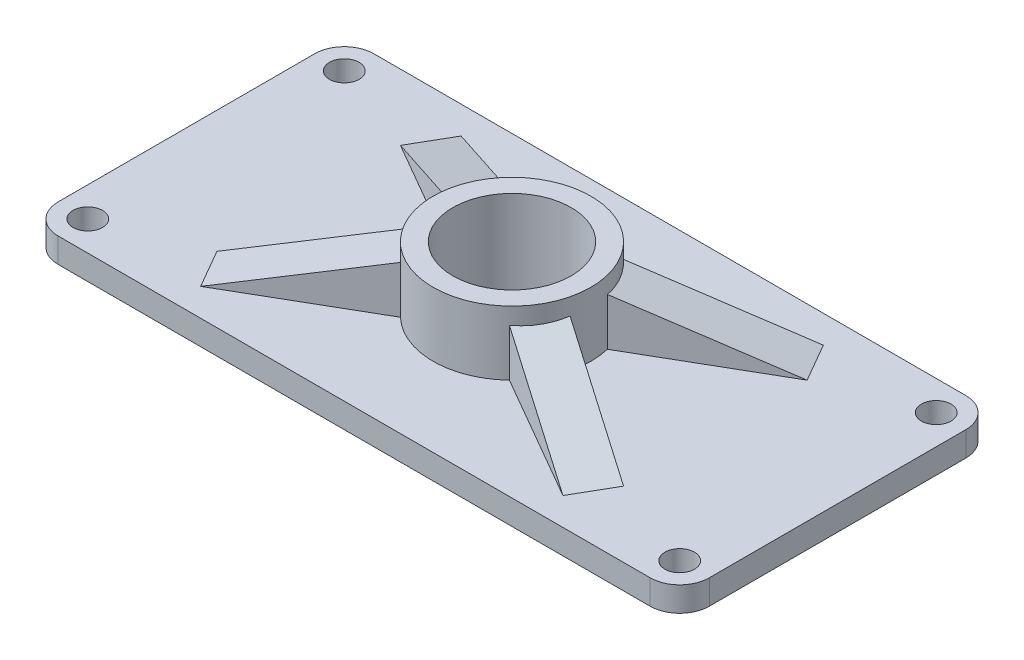
ISO-10303-21;
HEADER;
FILE_DESCRIPTION(('STEP AP214'),'2;1');
FILE_NAME('part.step','',(''),(''),'','','');
FILE_SCHEMA(('AUTOMOTIVE_DESIGN { 1 0 10303 214 1 1 1 1 }'));
ENDSEC;
DATA;
#1=APPLICATION_CONTEXT('core data for automotive mechanical design processes');
#2=APPLICATION_PROTOCOL_DEFINITION('international standard','automotive_design',2000,#1);
#3=PRODUCT_CONTEXT('',#1,'mechanical');
#4=PRODUCT('Part','Part','',(#3));
#5=PRODUCT_RELATED_PRODUCT_CATEGORY('part','',(#4));
#6=PRODUCT_DEFINITION_FORMATION('','',#4);
#7=PRODUCT_DEFINITION_CONTEXT('part definition',#1,'design');
#8=PRODUCT_DEFINITION('design','',#6,#7);
#9=PRODUCT_DEFINITION_SHAPE('','',#8);
#10=(LENGTH_UNIT() NAMED_UNIT(*) SI_UNIT(.MILLI.,.METRE.));
#11=(NAMED_UNIT(*) PLANE_ANGLE_UNIT() SI_UNIT($,.RADIAN.));
#12=(NAMED_UNIT(*) SI_UNIT($,.STERADIAN.) SOLID_ANGLE_UNIT());
#13=UNCERTAINTY_MEASURE_WITH_UNIT(LENGTH_MEASURE(1.E-05),#10,'distance_accuracy_value','');
#14=(GEOMETRIC_REPRESENTATION_CONTEXT(3) GLOBAL_UNCERTAINTY_ASSIGNED_CONTEXT((#13)) GLOBAL_UNIT_ASSIGNED_CONTEXT((#10,
#11,#12)) REPRESENTATION_CONTEXT('',''));
#15=CARTESIAN_POINT('',(0.,0.,0.));
#16=DIRECTION('',(0.,0.,1.));
#17=DIRECTION('',(1.,0.,0.));
#18=AXIS2_PLACEMENT_3D('',#15,#16,#17);
#19=CARTESIAN_POINT('',(60.,5.,-26.));
#20=DIRECTION('',(0.,-1.,0.));
#21=DIRECTION('',(0.,0.,-1.));
#22=AXIS2_PLACEMENT_3D('',#19,#20,#21);
#23=PLANE('',#22);
#24=CARTESIAN_POINT('',(60.,5.,26.));
#25=DIRECTION('',(0.,1.,0.));
#26=DIRECTION('',(0.,0.,1.));
#27=AXIS2_PLACEMENT_3D('',#24,#25,#26);
#28=CIRCLE('',#27,3.);
#29=CARTESIAN_POINT('',(60.,5.,29.));
#30=VERTEX_POINT('',#29);
#31=EDGE_CURVE('E339',#30,#30,#28,.T.);
#32=ORIENTED_EDGE('',*,*,#31,.F.);
#33=EDGE_LOOP('',(#32));
#34=FACE_BOUND('',#33,.T.);
#35=CARTESIAN_POINT('',(60.,5.,-26.));
#36=DIRECTION('',(0.,1.,0.));
#37=DIRECTION('',(0.,0.,1.));
#38=AXIS2_PLACEMENT_3D('',#35,#36,#37);
#39=CIRCLE('',#38,3.);
#40=CARTESIAN_POINT('',(60.,5.,-23.));
#41=VERTEX_POINT('',#40);
#42=EDGE_CURVE('E331',#41,#41,#39,.T.);
#43=ORIENTED_EDGE('',*,*,#42,.F.);
#44=EDGE_LOOP('',(#43));
#45=FACE_BOUND('',#44,.T.);
#46=CARTESIAN_POINT('',(-60.,5.,26.));
#47=DIRECTION('',(0.,1.,0.));
#48=DIRECTION('',(0.,0.,1.));
#49=AXIS2_PLACEMENT_3D('',#46,#47,#48);
#50=CIRCLE('',#49,3.);
#51=CARTESIAN_POINT('',(-60.,5.,29.));
#52=VERTEX_POINT('',#51);
#53=EDGE_CURVE('E323',#52,#52,#50,.T.);
#54=ORIENTED_EDGE('',*,*,#53,.F.);
#55=EDGE_LOOP('',(#54));
#56=FACE_BOUND('',#55,.T.);
#57=CARTESIAN_POINT('',(-60.,5.,-26.));
#58=DIRECTION('',(0.,1.,0.));
#59=DIRECTION('',(0.,0.,1.));
#60=AXIS2_PLACEMENT_3D('',#57,#58,#59);
#61=CIRCLE('',#60,3.);
#62=CARTESIAN_POINT('',(-60.,5.,-23.));
#63=VERTEX_POINT('',#62);
#64=EDGE_CURVE('E295',#63,#63,#61,.T.);
#65=ORIENTED_EDGE('',*,*,#64,.F.);
#66=EDGE_LOOP('',(#65));
#67=FACE_BOUND('',#66,.T.);
#68=CARTESIAN_POINT('',(60.,5.,-26.));
#69=DIRECTION('',(0.,1.,0.));
#70=DIRECTION('',(0.,0.,-1.));
#71=AXIS2_PLACEMENT_3D('',#68,#69,#70);
#72=CIRCLE('',#71,6.);
#73=CARTESIAN_POINT('',(66.,5.,-26.));
#74=VERTEX_POINT('',#73);
#75=CARTESIAN_POINT('',(60.,5.,-32.));
#76=VERTEX_POINT('',#75);
#77=EDGE_CURVE('E272',#74,#76,#72,.T.);
#78=ORIENTED_EDGE('',*,*,#77,.T.);
#79=DIRECTION('',(-1.,0.,0.));
#80=VECTOR('',#79,1.);
#81=CARTESIAN_POINT('',(-60.,5.,-32.));
#82=LINE('',#81,#80);
#83=CARTESIAN_POINT('',(-60.,5.,-32.));
#84=VERTEX_POINT('',#83);
#85=EDGE_CURVE('E313',#76,#84,#82,.T.);
#86=ORIENTED_EDGE('',*,*,#85,.T.);
#87=CARTESIAN_POINT('',(-60.,5.,-26.));
#88=DIRECTION('',(0.,1.,0.));
#89=DIRECTION('',(0.,0.,1.));
#90=AXIS2_PLACEMENT_3D('',#87,#88,#89);
#91=CIRCLE('',#90,6.);
#92=CARTESIAN_POINT('',(-66.,5.,-26.));
#93=VERTEX_POINT('',#92);
#94=EDGE_CURVE('E310',#84,#93,#91,.T.);
#95=ORIENTED_EDGE('',*,*,#94,.T.);
#96=DIRECTION('',(0.,0.,1.));
#97=VECTOR('',#96,1.);
#98=CARTESIAN_POINT('',(-66.,5.,-26.));
#99=LINE('',#98,#97);
#100=CARTESIAN_POINT('',(-66.,5.,26.));
#101=VERTEX_POINT('',#100);
#102=EDGE_CURVE('E307',#93,#101,#99,.T.);
#103=ORIENTED_EDGE('',*,*,#102,.T.);
#104=CARTESIAN_POINT('',(-60.,5.,26.));
#105=DIRECTION('',(0.,1.,0.));
#106=DIRECTION('',(0.,0.,1.));
#107=AXIS2_PLACEMENT_3D('',#104,#105,#106);
#108=CIRCLE('',#107,6.);
#109=CARTESIAN_POINT('',(-60.,5.,32.));
#110=VERTEX_POINT('',#109);
#111=EDGE_CURVE('E304',#101,#110,#108,.T.);
#112=ORIENTED_EDGE('',*,*,#111,.T.);
#113=DIRECTION('',(1.,0.,0.));
#114=VECTOR('',#113,1.);
#115=CARTESIAN_POINT('',(-60.,5.,32.));
#116=LINE('',#115,#114);
#117=CARTESIAN_POINT('',(60.,5.,32.));
#118=VERTEX_POINT('',#117);
#119=EDGE_CURVE('E301',#110,#118,#116,.T.);
#120=ORIENTED_EDGE('',*,*,#119,.T.);
#121=CARTESIAN_POINT('',(60.,5.,26.));
#122=DIRECTION('',(0.,1.,0.));
#123=DIRECTION('',(0.,0.,1.));
#124=AXIS2_PLACEMENT_3D('',#121,#122,#123);
#125=CIRCLE('',#124,6.);
#126=CARTESIAN_POINT('',(66.,5.,26.));
#127=VERTEX_POINT('',#126);
#128=EDGE_CURVE('E298',#118,#127,#125,.T.);
#129=ORIENTED_EDGE('',*,*,#128,.T.);
#130=DIRECTION('',(0.,0.,-1.));
#131=VECTOR('',#130,1.);
#132=CARTESIAN_POINT('',(66.,5.,-26.));
#133=LINE('',#132,#131);
#134=EDGE_CURVE('E268',#127,#74,#133,.T.);
#135=ORIENTED_EDGE('',*,*,#134,.T.);
#136=EDGE_LOOP('',(#78,#86,#95,#103,#112,#120,#129,#135));
#137=FACE_BOUND('',#136,.T.);
#138=CARTESIAN_POINT('',(0.,5.,0.));
#139=DIRECTION('',(0.,-1.,0.));
#140=DIRECTION('',(0.,0.,-1.));
#141=AXIS2_PLACEMENT_3D('',#138,#139,#140);
#142=CIRCLE('',#141,16.);
#143=CARTESIAN_POINT('',(15.5470861469722,5.,3.77996194936209));
#144=VERTEX_POINT('',#143);
#145=CARTESIAN_POINT('',(15.5470861469722,5.,-3.77996194936209));
#146=VERTEX_POINT('',#145);
#147=EDGE_CURVE('E189',#144,#146,#142,.F.);
#148=ORIENTED_EDGE('',*,*,#147,.F.);
#149=DIRECTION('',(0.866025403784438,0.,0.500000000000001));
#150=VECTOR('',#149,1.);
#151=CARTESIAN_POINT('',(14.9847472796077,5.00000000000001,3.45529545291341));
#152=LINE('',#151,#150);
#153=CARTESIAN_POINT('',(41.2211431702997,5.,18.6028856829701));
#154=VERTEX_POINT('',#153);
#155=EDGE_CURVE('E59',#144,#154,#152,.T.);
#156=ORIENTED_EDGE('',*,*,#155,.T.);
#157=DIRECTION('',(-0.500000000000001,0.,0.866025403784438));
#158=VECTOR('',#157,1.);
#159=CARTESIAN_POINT('',(41.2211431702997,5.,18.6028856829701));
#160=LINE('',#159,#158);
#161=CARTESIAN_POINT('',(36.7211431702997,5.,26.39711431703));
#162=VERTEX_POINT('',#161);
#163=EDGE_CURVE('E63',#154,#162,#160,.T.);
#164=ORIENTED_EDGE('',*,*,#163,.T.);
#165=DIRECTION('',(0.866025403784438,0.,0.500000000000001));
#166=VECTOR('',#165,1.);
#167=CARTESIAN_POINT('',(10.4847472796077,5.00000000000001,11.2495240869734));
#168=LINE('',#167,#166);
#169=CARTESIAN_POINT('',(11.0470861469722,5.00000000000001,11.574190583422));
#170=VERTEX_POINT('',#169);
#171=EDGE_CURVE('E192',#170,#162,#168,.T.);
#172=ORIENTED_EDGE('',*,*,#171,.F.);
#173=CARTESIAN_POINT('',(-11.0470861469722,5.,11.574190583422));
#174=VERTEX_POINT('',#173);
#175=EDGE_CURVE('E179',#174,#170,#142,.F.);
#176=ORIENTED_EDGE('',*,*,#175,.F.);
#177=DIRECTION('',(0.866025403784438,0.,-0.500000000000001));
#178=VECTOR('',#177,1.);
#179=CARTESIAN_POINT('',(-10.4847472796077,5.00000000000001,11.2495240869734));
#180=LINE('',#179,#178);
#181=CARTESIAN_POINT('',(-36.7211431702997,5.,26.39711431703));
#182=VERTEX_POINT('',#181);
#183=EDGE_CURVE('E370',#182,#174,#180,.T.);
#184=ORIENTED_EDGE('',*,*,#183,.F.);
#185=DIRECTION('',(-0.500000000000001,0.,-0.866025403784438));
#186=VECTOR('',#185,1.);
#187=CARTESIAN_POINT('',(-36.7211431702997,5.,26.39711431703));
#188=LINE('',#187,#186);
#189=CARTESIAN_POINT('',(-41.2211431702997,5.,18.6028856829701));
#190=VERTEX_POINT('',#189);
#191=EDGE_CURVE('E362',#182,#190,#188,.T.);
#192=ORIENTED_EDGE('',*,*,#191,.T.);
#193=DIRECTION('',(0.866025403784438,0.,-0.500000000000001));
#194=VECTOR('',#193,1.);
#195=CARTESIAN_POINT('',(-14.9847472796077,5.00000000000001,3.45529545291341));
#196=LINE('',#195,#194);
#197=CARTESIAN_POINT('',(-15.5470861469722,5.00000000000001,3.77996194936209));
#198=VERTEX_POINT('',#197);
#199=EDGE_CURVE('E371',#190,#198,#196,.T.);
#200=ORIENTED_EDGE('',*,*,#199,.T.);
#201=CARTESIAN_POINT('',(-15.5470861469722,5.,-3.77996194936209));
#202=VERTEX_POINT('',#201);
#203=EDGE_CURVE('E239',#202,#198,#142,.F.);
#204=ORIENTED_EDGE('',*,*,#203,.F.);
#205=DIRECTION('',(0.866025403784438,0.,0.500000000000001));
#206=VECTOR('',#205,1.);
#207=CARTESIAN_POINT('',(-14.9847472796077,5.00000000000001,-3.45529545291341));
#208=LINE('',#207,#206);
#209=CARTESIAN_POINT('',(-41.2211431702997,5.,-18.6028856829701));
#210=VERTEX_POINT('',#209);
#211=EDGE_CURVE('E409',#210,#202,#208,.T.);
#212=ORIENTED_EDGE('',*,*,#211,.F.);
#213=DIRECTION('',(-0.500000000000001,0.,0.866025403784438));
#214=VECTOR('',#213,1.);
#215=CARTESIAN_POINT('',(-36.7211431702997,5.,-26.39711431703));
#216=LINE('',#215,#214);
#217=CARTESIAN_POINT('',(-36.7211431702997,5.,-26.39711431703));
#218=VERTEX_POINT('',#217);
#219=EDGE_CURVE('E399',#218,#210,#216,.T.);
#220=ORIENTED_EDGE('',*,*,#219,.F.);
#221=DIRECTION('',(0.866025403784438,0.,0.500000000000001));
#222=VECTOR('',#221,1.);
#223=CARTESIAN_POINT('',(-10.4847472796077,5.00000000000001,-11.2495240869734));
#224=LINE('',#223,#222);
#225=CARTESIAN_POINT('',(-11.0470861469722,5.,-11.574190583422));
#226=VERTEX_POINT('',#225);
#227=EDGE_CURVE('E408',#218,#226,#224,.T.);
#228=ORIENTED_EDGE('',*,*,#227,.T.);
#229=CARTESIAN_POINT('',(11.0470861469722,5.,-11.574190583422));
#230=VERTEX_POINT('',#229);
#231=EDGE_CURVE('E191',#230,#226,#142,.F.);
#232=ORIENTED_EDGE('',*,*,#231,.F.);
#233=DIRECTION('',(0.866025403784438,0.,-0.500000000000001));
#234=VECTOR('',#233,1.);
#235=CARTESIAN_POINT('',(10.4847472796077,5.00000000000001,-11.2495240869734));
#236=LINE('',#235,#234);
#237=CARTESIAN_POINT('',(36.7211431702996,5.00000000000002,-26.39711431703));
#238=VERTEX_POINT('',#237);
#239=EDGE_CURVE('E385',#230,#238,#236,.T.);
#240=ORIENTED_EDGE('',*,*,#239,.T.);
#241=DIRECTION('',(-0.500000000000001,0.,-0.866025403784438));
#242=VECTOR('',#241,1.);
#243=CARTESIAN_POINT('',(41.2211431702997,5.,-18.6028856829701));
#244=LINE('',#243,#242);
#245=CARTESIAN_POINT('',(41.2211431702997,5.,-18.6028856829701));
#246=VERTEX_POINT('',#245);
#247=EDGE_CURVE('E390',#246,#238,#244,.T.);
#248=ORIENTED_EDGE('',*,*,#247,.F.);
#249=DIRECTION('',(0.866025403784438,0.,-0.500000000000001));
#250=VECTOR('',#249,1.);
#251=CARTESIAN_POINT('',(14.9847472796077,5.00000000000001,-3.45529545291341));
#252=LINE('',#251,#250);
#253=EDGE_CURVE('E386',#146,#246,#252,.T.);
#254=ORIENTED_EDGE('',*,*,#253,.F.);
#255=EDGE_LOOP('',(#148,#156,#164,#172,#176,#184,#192,#200,#204,#212,#220,#228,#232,#240,#248,#254));
#256=FACE_BOUND('',#255,.T.);
#257=ADVANCED_FACE('F43',(#34,#45,#56,#67,#137,#256),#23,.F.);
#258=CARTESIAN_POINT('',(60.,0.,-26.));
#259=DIRECTION('',(0.,-1.,0.));
#260=DIRECTION('',(0.,0.,-1.));
#261=AXIS2_PLACEMENT_3D('',#258,#259,#260);
#262=PLANE('',#261);
#263=CARTESIAN_POINT('',(0.,0.,0.));
#264=DIRECTION('',(0.,1.,0.));
#265=DIRECTION('',(0.,0.,1.));
#266=AXIS2_PLACEMENT_3D('',#263,#264,#265);
#267=CIRCLE('',#266,12.);
#268=CARTESIAN_POINT('',(0.,0.,12.));
#269=VERTEX_POINT('',#268);
#270=EDGE_CURVE('E347',#269,#269,#267,.T.);
#271=ORIENTED_EDGE('',*,*,#270,.T.);
#272=EDGE_LOOP('',(#271));
#273=FACE_BOUND('',#272,.T.);
#274=CARTESIAN_POINT('',(60.,0.,-26.));
#275=DIRECTION('',(0.,1.,0.));
#276=DIRECTION('',(0.,0.,1.));
#277=AXIS2_PLACEMENT_3D('',#274,#275,#276);
#278=CIRCLE('',#277,3.);
#279=CARTESIAN_POINT('',(60.,0.,-23.));
#280=VERTEX_POINT('',#279);
#281=EDGE_CURVE('E335',#280,#280,#278,.T.);
#282=ORIENTED_EDGE('',*,*,#281,.T.);
#283=EDGE_LOOP('',(#282));
#284=FACE_BOUND('',#283,.T.);
#285=CARTESIAN_POINT('',(-60.,0.,-26.));
#286=DIRECTION('',(0.,1.,0.));
#287=DIRECTION('',(0.,0.,1.));
#288=AXIS2_PLACEMENT_3D('',#285,#286,#287);
#289=CIRCLE('',#288,3.);
#290=CARTESIAN_POINT('',(-60.,0.,-23.));
#291=VERTEX_POINT('',#290);
#292=EDGE_CURVE('E319',#291,#291,#289,.T.);
#293=ORIENTED_EDGE('',*,*,#292,.T.);
#294=EDGE_LOOP('',(#293));
#295=FACE_BOUND('',#294,.T.);
#296=CARTESIAN_POINT('',(60.,0.,-26.));
#297=DIRECTION('',(0.,1.,0.));
#298=DIRECTION('',(0.,0.,-1.));
#299=AXIS2_PLACEMENT_3D('',#296,#297,#298);
#300=CIRCLE('',#299,6.);
#301=CARTESIAN_POINT('',(66.,0.,-26.));
#302=VERTEX_POINT('',#301);
#303=CARTESIAN_POINT('',(60.,0.,-32.));
#304=VERTEX_POINT('',#303);
#305=EDGE_CURVE('E291',#302,#304,#300,.T.);
#306=ORIENTED_EDGE('',*,*,#305,.F.);
#307=DIRECTION('',(0.,0.,-1.));
#308=VECTOR('',#307,1.);
#309=CARTESIAN_POINT('',(66.,0.,-26.));
#310=LINE('',#309,#308);
#311=CARTESIAN_POINT('',(66.,0.,26.));
#312=VERTEX_POINT('',#311);
#313=EDGE_CURVE('E269',#312,#302,#310,.T.);
#314=ORIENTED_EDGE('',*,*,#313,.F.);
#315=CARTESIAN_POINT('',(60.,0.,26.));
#316=DIRECTION('',(0.,1.,0.));
#317=DIRECTION('',(0.,0.,1.));
#318=AXIS2_PLACEMENT_3D('',#315,#316,#317);
#319=CIRCLE('',#318,6.);
#320=CARTESIAN_POINT('',(60.,0.,32.));
#321=VERTEX_POINT('',#320);
#322=EDGE_CURVE('E273',#321,#312,#319,.T.);
#323=ORIENTED_EDGE('',*,*,#322,.F.);
#324=DIRECTION('',(1.,0.,0.));
#325=VECTOR('',#324,1.);
#326=CARTESIAN_POINT('',(-60.,0.,32.));
#327=LINE('',#326,#325);
#328=CARTESIAN_POINT('',(-60.,0.,32.));
#329=VERTEX_POINT('',#328);
#330=EDGE_CURVE('E276',#329,#321,#327,.T.);
#331=ORIENTED_EDGE('',*,*,#330,.F.);
#332=CARTESIAN_POINT('',(-60.,0.,26.));
#333=DIRECTION('',(0.,1.,0.));
#334=DIRECTION('',(0.,0.,1.));
#335=AXIS2_PLACEMENT_3D('',#332,#333,#334);
#336=CIRCLE('',#335,6.);
#337=CARTESIAN_POINT('',(-66.,0.,26.));
#338=VERTEX_POINT('',#337);
#339=EDGE_CURVE('E279',#338,#329,#336,.T.);
#340=ORIENTED_EDGE('',*,*,#339,.F.);
#341=DIRECTION('',(0.,0.,1.));
#342=VECTOR('',#341,1.);
#343=CARTESIAN_POINT('',(-66.,0.,-26.));
#344=LINE('',#343,#342);
#345=CARTESIAN_POINT('',(-66.,0.,-26.));
#346=VERTEX_POINT('',#345);
#347=EDGE_CURVE('E282',#346,#338,#344,.T.);
#348=ORIENTED_EDGE('',*,*,#347,.F.);
#349=CARTESIAN_POINT('',(-60.,0.,-26.));
#350=DIRECTION('',(0.,1.,0.));
#351=DIRECTION('',(0.,0.,1.));
#352=AXIS2_PLACEMENT_3D('',#349,#350,#351);
#353=CIRCLE('',#352,6.);
#354=CARTESIAN_POINT('',(-60.,0.,-32.));
#355=VERTEX_POINT('',#354);
#356=EDGE_CURVE('E285',#355,#346,#353,.T.);
#357=ORIENTED_EDGE('',*,*,#356,.F.);
#358=DIRECTION('',(-1.,0.,0.));
#359=VECTOR('',#358,1.);
#360=CARTESIAN_POINT('',(-60.,0.,-32.));
#361=LINE('',#360,#359);
#362=EDGE_CURVE('E288',#304,#355,#361,.T.);
#363=ORIENTED_EDGE('',*,*,#362,.F.);
#364=EDGE_LOOP('',(#306,#314,#323,#331,#340,#348,#357,#363));
#365=FACE_BOUND('',#364,.T.);
#366=CARTESIAN_POINT('',(-60.,0.,26.));
#367=DIRECTION('',(0.,1.,0.));
#368=DIRECTION('',(0.,0.,1.));
#369=AXIS2_PLACEMENT_3D('',#366,#367,#368);
#370=CIRCLE('',#369,3.);
#371=CARTESIAN_POINT('',(-60.,0.,29.));
#372=VERTEX_POINT('',#371);
#373=EDGE_CURVE('E327',#372,#372,#370,.T.);
#374=ORIENTED_EDGE('',*,*,#373,.T.);
#375=EDGE_LOOP('',(#374));
#376=FACE_BOUND('',#375,.T.);
#377=CARTESIAN_POINT('',(60.,0.,26.));
#378=DIRECTION('',(0.,1.,0.));
#379=DIRECTION('',(0.,0.,1.));
#380=AXIS2_PLACEMENT_3D('',#377,#378,#379);
#381=CIRCLE('',#380,3.);
#382=CARTESIAN_POINT('',(60.,0.,29.));
#383=VERTEX_POINT('',#382);
#384=EDGE_CURVE('E343',#383,#383,#381,.T.);
#385=ORIENTED_EDGE('',*,*,#384,.T.);
#386=EDGE_LOOP('',(#385));
#387=FACE_BOUND('',#386,.T.);
#388=ADVANCED_FACE('F461',(#273,#284,#295,#365,#376,#387),#262,.T.);
#389=CARTESIAN_POINT('',(60.,5.,-26.));
#390=DIRECTION('',(0.,-1.,0.));
#391=DIRECTION('',(0.,0.,-1.));
#392=AXIS2_PLACEMENT_3D('',#389,#390,#391);
#393=CYLINDRICAL_SURFACE('',#392,6.);
#394=ORIENTED_EDGE('',*,*,#305,.T.);
#395=DIRECTION('',(0.,-1.,0.));
#396=VECTOR('',#395,1.);
#397=CARTESIAN_POINT('',(60.,5.,-32.));
#398=LINE('',#397,#396);
#399=EDGE_CURVE('E235',#76,#304,#398,.T.);
#400=ORIENTED_EDGE('',*,*,#399,.F.);
#401=ORIENTED_EDGE('',*,*,#77,.F.);
#402=DIRECTION('',(0.,-1.,0.));
#403=VECTOR('',#402,1.);
#404=CARTESIAN_POINT('',(66.,5.,-26.));
#405=LINE('',#404,#403);
#406=EDGE_CURVE('E264',#74,#302,#405,.T.);
#407=ORIENTED_EDGE('',*,*,#406,.T.);
#408=EDGE_LOOP('',(#394,#400,#401,#407));
#409=FACE_BOUND('',#408,.T.);
#410=ADVANCED_FACE('F45',(#409),#393,.T.);
#411=CARTESIAN_POINT('',(-60.,5.,-32.));
#412=DIRECTION('',(0.,0.,1.));
#413=DIRECTION('',(1.,0.,0.));
#414=AXIS2_PLACEMENT_3D('',#411,#412,#413);
#415=PLANE('',#414);
#416=ORIENTED_EDGE('',*,*,#362,.T.);
#417=DIRECTION('',(0.,-1.,0.));
#418=VECTOR('',#417,1.);
#419=CARTESIAN_POINT('',(-60.,5.,-32.));
#420=LINE('',#419,#418);
#421=EDGE_CURVE('E240',#84,#355,#420,.T.);
#422=ORIENTED_EDGE('',*,*,#421,.F.);
#423=ORIENTED_EDGE('',*,*,#85,.F.);
#424=ORIENTED_EDGE('',*,*,#399,.T.);
#425=EDGE_LOOP('',(#416,#422,#423,#424));
#426=FACE_BOUND('',#425,.T.);
#427=ADVANCED_FACE('F497',(#426),#415,.F.);
#428=CARTESIAN_POINT('',(-60.,5.,-26.));
#429=DIRECTION('',(0.,-1.,0.));
#430=DIRECTION('',(0.,0.,-1.));
#431=AXIS2_PLACEMENT_3D('',#428,#429,#430);
#432=CYLINDRICAL_SURFACE('',#431,6.);
#433=ORIENTED_EDGE('',*,*,#356,.T.);
#434=DIRECTION('',(0.,-1.,0.));
#435=VECTOR('',#434,1.);
#436=CARTESIAN_POINT('',(-66.,5.,-26.));
#437=LINE('',#436,#435);
#438=EDGE_CURVE('E244',#93,#346,#437,.T.);
#439=ORIENTED_EDGE('',*,*,#438,.F.);
#440=ORIENTED_EDGE('',*,*,#94,.F.);
#441=ORIENTED_EDGE('',*,*,#421,.T.);
#442=EDGE_LOOP('',(#433,#439,#440,#441));
#443=FACE_BOUND('',#442,.T.);
#444=ADVANCED_FACE('F494',(#443),#432,.T.);
#445=CARTESIAN_POINT('',(-66.,5.,-26.));
#446=DIRECTION('',(1.,0.,0.));
#447=DIRECTION('',(0.,0.,-1.));
#448=AXIS2_PLACEMENT_3D('',#445,#446,#447);
#449=PLANE('',#448);
#450=ORIENTED_EDGE('',*,*,#347,.T.);
#451=DIRECTION('',(0.,-1.,0.));
#452=VECTOR('',#451,1.);
#453=CARTESIAN_POINT('',(-66.,5.,26.));
#454=LINE('',#453,#452);
#455=EDGE_CURVE('E248',#101,#338,#454,.T.);
#456=ORIENTED_EDGE('',*,*,#455,.F.);
#457=ORIENTED_EDGE('',*,*,#102,.F.);
#458=ORIENTED_EDGE('',*,*,#438,.T.);
#459=EDGE_LOOP('',(#450,#456,#457,#458));
#460=FACE_BOUND('',#459,.T.);
#461=ADVANCED_FACE('F490',(#460),#449,.F.);
#462=CARTESIAN_POINT('',(-60.,5.,26.));
#463=DIRECTION('',(0.,-1.,0.));
#464=DIRECTION('',(0.,0.,-1.));
#465=AXIS2_PLACEMENT_3D('',#462,#463,#464);
#466=CYLINDRICAL_SURFACE('',#465,6.);
#467=ORIENTED_EDGE('',*,*,#339,.T.);
#468=DIRECTION('',(0.,-1.,0.));
#469=VECTOR('',#468,1.);
#470=CARTESIAN_POINT('',(-60.,5.,32.));
#471=LINE('',#470,#469);
#472=EDGE_CURVE('E252',#110,#329,#471,.T.);
#473=ORIENTED_EDGE('',*,*,#472,.F.);
#474=ORIENTED_EDGE('',*,*,#111,.F.);
#475=ORIENTED_EDGE('',*,*,#455,.T.);
#476=EDGE_LOOP('',(#467,#473,#474,#475));
#477=FACE_BOUND('',#476,.T.);
#478=ADVANCED_FACE('F486',(#477),#466,.T.);
#479=CARTESIAN_POINT('',(-60.,5.,32.));
#480=DIRECTION('',(0.,0.,-1.));
#481=DIRECTION('',(-1.,0.,0.));
#482=AXIS2_PLACEMENT_3D('',#479,#480,#481);
#483=PLANE('',#482);
#484=ORIENTED_EDGE('',*,*,#330,.T.);
#485=DIRECTION('',(0.,-1.,0.));
#486=VECTOR('',#485,1.);
#487=CARTESIAN_POINT('',(60.,5.,32.));
#488=LINE('',#487,#486);
#489=EDGE_CURVE('E256',#118,#321,#488,.T.);
#490=ORIENTED_EDGE('',*,*,#489,.F.);
#491=ORIENTED_EDGE('',*,*,#119,.F.);
#492=ORIENTED_EDGE('',*,*,#472,.T.);
#493=EDGE_LOOP('',(#484,#490,#491,#492));
#494=FACE_BOUND('',#493,.T.);
#495=ADVANCED_FACE('F482',(#494),#483,.F.);
#496=CARTESIAN_POINT('',(60.,5.,26.));
#497=DIRECTION('',(0.,-1.,0.));
#498=DIRECTION('',(0.,0.,-1.));
#499=AXIS2_PLACEMENT_3D('',#496,#497,#498);
#500=CYLINDRICAL_SURFACE('',#499,6.);
#501=ORIENTED_EDGE('',*,*,#322,.T.);
#502=DIRECTION('',(0.,-1.,0.));
#503=VECTOR('',#502,1.);
#504=CARTESIAN_POINT('',(66.,5.,26.));
#505=LINE('',#504,#503);
#506=EDGE_CURVE('E260',#127,#312,#505,.T.);
#507=ORIENTED_EDGE('',*,*,#506,.F.);
#508=ORIENTED_EDGE('',*,*,#128,.F.);
#509=ORIENTED_EDGE('',*,*,#489,.T.);
#510=EDGE_LOOP('',(#501,#507,#508,#509));
#511=FACE_BOUND('',#510,.T.);
#512=ADVANCED_FACE('F478',(#511),#500,.T.);
#513=CARTESIAN_POINT('',(66.,5.,-26.));
#514=DIRECTION('',(-1.,0.,0.));
#515=DIRECTION('',(0.,0.,1.));
#516=AXIS2_PLACEMENT_3D('',#513,#514,#515);
#517=PLANE('',#516);
#518=ORIENTED_EDGE('',*,*,#313,.T.);
#519=ORIENTED_EDGE('',*,*,#406,.F.);
#520=ORIENTED_EDGE('',*,*,#134,.F.);
#521=ORIENTED_EDGE('',*,*,#506,.T.);
#522=EDGE_LOOP('',(#518,#519,#520,#521));
#523=FACE_BOUND('',#522,.T.);
#524=ADVANCED_FACE('F475',(#523),#517,.F.);
#525=CARTESIAN_POINT('',(-60.,5.,-26.));
#526=DIRECTION('',(0.,-1.,0.));
#527=DIRECTION('',(0.,0.,-1.));
#528=AXIS2_PLACEMENT_3D('',#525,#526,#527);
#529=CYLINDRICAL_SURFACE('',#528,3.);
#530=ORIENTED_EDGE('',*,*,#64,.T.);
#531=EDGE_LOOP('',(#530));
#532=FACE_BOUND('',#531,.T.);
#533=ORIENTED_EDGE('',*,*,#292,.F.);
#534=EDGE_LOOP('',(#533));
#535=FACE_BOUND('',#534,.T.);
#536=ADVANCED_FACE('F472',(#532,#535),#529,.F.);
#537=CARTESIAN_POINT('',(-60.,5.,26.));
#538=DIRECTION('',(0.,-1.,0.));
#539=DIRECTION('',(0.,0.,-1.));
#540=AXIS2_PLACEMENT_3D('',#537,#538,#539);
#541=CYLINDRICAL_SURFACE('',#540,3.);
#542=ORIENTED_EDGE('',*,*,#53,.T.);
#543=EDGE_LOOP('',(#542));
#544=FACE_BOUND('',#543,.T.);
#545=ORIENTED_EDGE('',*,*,#373,.F.);
#546=EDGE_LOOP('',(#545));
#547=FACE_BOUND('',#546,.T.);
#548=ADVANCED_FACE('F546',(#544,#547),#541,.F.);
#549=CARTESIAN_POINT('',(60.,5.,-26.));
#550=DIRECTION('',(0.,-1.,0.));
#551=DIRECTION('',(0.,0.,-1.));
#552=AXIS2_PLACEMENT_3D('',#549,#550,#551);
#553=CYLINDRICAL_SURFACE('',#552,3.);
#554=ORIENTED_EDGE('',*,*,#42,.T.);
#555=EDGE_LOOP('',(#554));
#556=FACE_BOUND('',#555,.T.);
#557=ORIENTED_EDGE('',*,*,#281,.F.);
#558=EDGE_LOOP('',(#557));
#559=FACE_BOUND('',#558,.T.);
#560=ADVANCED_FACE('F537',(#556,#559),#553,.F.);
#561=CARTESIAN_POINT('',(60.,5.,26.));
#562=DIRECTION('',(0.,-1.,0.));
#563=DIRECTION('',(0.,0.,-1.));
#564=AXIS2_PLACEMENT_3D('',#561,#562,#563);
#565=CYLINDRICAL_SURFACE('',#564,3.);
#566=ORIENTED_EDGE('',*,*,#31,.T.);
#567=EDGE_LOOP('',(#566));
#568=FACE_BOUND('',#567,.T.);
#569=ORIENTED_EDGE('',*,*,#384,.F.);
#570=EDGE_LOOP('',(#569));
#571=FACE_BOUND('',#570,.T.);
#572=ADVANCED_FACE('F534',(#568,#571),#565,.F.);
#573=CARTESIAN_POINT('',(0.,0.,0.));
#574=DIRECTION('',(0.,1.,0.));
#575=DIRECTION('',(0.,0.,1.));
#576=AXIS2_PLACEMENT_3D('',#573,#574,#575);
#577=CYLINDRICAL_SURFACE('',#576,12.);
#578=ORIENTED_EDGE('',*,*,#270,.F.);
#579=EDGE_LOOP('',(#578));
#580=FACE_BOUND('',#579,.T.);
#581=CARTESIAN_POINT('',(0.,18.,0.));
#582=DIRECTION('',(0.,1.,0.));
#583=DIRECTION('',(0.,0.,1.));
#584=AXIS2_PLACEMENT_3D('',#581,#582,#583);
#585=CIRCLE('',#584,12.);
#586=CARTESIAN_POINT('',(0.,18.,12.));
#587=VERTEX_POINT('',#586);
#588=EDGE_CURVE('E358',#587,#587,#585,.T.);
#589=ORIENTED_EDGE('',*,*,#588,.T.);
#590=EDGE_LOOP('',(#589));
#591=FACE_BOUND('',#590,.T.);
#592=ADVANCED_FACE('F536',(#580,#591),#577,.F.);
#593=CARTESIAN_POINT('',(0.,18.,0.));
#594=DIRECTION('',(0.,1.,0.));
#595=DIRECTION('',(0.,0.,1.));
#596=AXIS2_PLACEMENT_3D('',#593,#594,#595);
#597=PLANE('',#596);
#598=CARTESIAN_POINT('',(0.,18.,0.));
#599=DIRECTION('',(0.,1.,0.));
#600=DIRECTION('',(0.,0.,1.));
#601=AXIS2_PLACEMENT_3D('',#598,#599,#600);
#602=CIRCLE('',#601,16.);
#603=CARTESIAN_POINT('',(0.,18.,16.));
#604=VERTEX_POINT('',#603);
#605=EDGE_CURVE('E354',#604,#604,#602,.T.);
#606=ORIENTED_EDGE('',*,*,#605,.T.);
#607=EDGE_LOOP('',(#606));
#608=FACE_BOUND('',#607,.T.);
#609=ORIENTED_EDGE('',*,*,#588,.F.);
#610=EDGE_LOOP('',(#609));
#611=FACE_BOUND('',#610,.T.);
#612=ADVANCED_FACE('F456',(#608,#611),#597,.T.);
#613=CARTESIAN_POINT('',(0.,18.,0.));
#614=DIRECTION('',(0.,-1.,0.));
#615=DIRECTION('',(0.,0.,-1.));
#616=AXIS2_PLACEMENT_3D('',#613,#614,#615);
#617=CYLINDRICAL_SURFACE('',#616,16.);
#618=ORIENTED_EDGE('',*,*,#605,.F.);
#619=EDGE_LOOP('',(#618));
#620=FACE_BOUND('',#619,.T.);
#621=CARTESIAN_POINT('',(0.,19.6213863304808,0.));
#622=DIRECTION('',(0.267616567329818,0.951056516295153,0.154508497187475));
#623=DIRECTION('',(0.823639103546331,-0.309016994374949,0.475528258147578));
#624=AXIS2_PLACEMENT_3D('',#621,#622,#623);
#625=ELLIPSE('',#624,16.8233955878123,16.);
#626=CARTESIAN_POINT('',(11.0470861469722,14.6325197536149,11.574190583422));
#627=VERTEX_POINT('',#626);
#628=CARTESIAN_POINT('',(15.5470861469722,14.6325197536149,3.77996194936209));
#629=VERTEX_POINT('',#628);
#630=EDGE_CURVE('E52',#627,#629,#625,.T.);
#631=ORIENTED_EDGE('',*,*,#630,.T.);
#632=DIRECTION('',(0.,-1.,0.));
#633=VECTOR('',#632,1.);
#634=CARTESIAN_POINT('',(15.5470861469722,18.,3.77996194936209));
#635=LINE('',#634,#633);
#636=EDGE_CURVE('E11',#629,#144,#635,.T.);
#637=ORIENTED_EDGE('',*,*,#636,.T.);
#638=ORIENTED_EDGE('',*,*,#147,.T.);
#639=DIRECTION('',(0.,-1.,0.));
#640=VECTOR('',#639,1.);
#641=CARTESIAN_POINT('',(15.5470861469722,18.,-3.77996194936209));
#642=LINE('',#641,#640);
#643=CARTESIAN_POINT('',(15.5470861469722,14.6325197536149,-3.77996194936209));
#644=VERTEX_POINT('',#643);
#645=EDGE_CURVE('E215',#146,#644,#642,.F.);
#646=ORIENTED_EDGE('',*,*,#645,.T.);
#647=CARTESIAN_POINT('',(0.,19.6213863304808,0.));
#648=DIRECTION('',(-0.267616567329818,-0.951056516295153,0.154508497187475));
#649=DIRECTION('',(0.823639103546331,-0.309016994374949,-0.475528258147578));
#650=AXIS2_PLACEMENT_3D('',#647,#648,#649);
#651=ELLIPSE('',#650,16.8233955878123,16.);
#652=CARTESIAN_POINT('',(11.0470861469722,14.6325197536149,-11.574190583422));
#653=VERTEX_POINT('',#652);
#654=EDGE_CURVE('E218',#653,#644,#651,.T.);
#655=ORIENTED_EDGE('',*,*,#654,.F.);
#656=DIRECTION('',(0.,-1.,0.));
#657=VECTOR('',#656,1.);
#658=CARTESIAN_POINT('',(11.0470861469722,18.,-11.574190583422));
#659=LINE('',#658,#657);
#660=EDGE_CURVE('E222',#230,#653,#659,.F.);
#661=ORIENTED_EDGE('',*,*,#660,.F.);
#662=ORIENTED_EDGE('',*,*,#231,.T.);
#663=DIRECTION('',(0.,-1.,0.));
#664=VECTOR('',#663,1.);
#665=CARTESIAN_POINT('',(-11.0470861469722,18.,-11.574190583422));
#666=LINE('',#665,#664);
#667=CARTESIAN_POINT('',(-11.0470861469722,14.6325197536149,-11.574190583422));
#668=VERTEX_POINT('',#667);
#669=EDGE_CURVE('E202',#226,#668,#666,.F.);
#670=ORIENTED_EDGE('',*,*,#669,.T.);
#671=CARTESIAN_POINT('',(0.,19.6213863304808,0.));
#672=DIRECTION('',(-0.267616567329818,0.951056516295153,-0.154508497187475));
#673=DIRECTION('',(-0.823639103546331,-0.309016994374949,-0.475528258147578));
#674=AXIS2_PLACEMENT_3D('',#671,#672,#673);
#675=ELLIPSE('',#674,16.8233955878123,16.);
#676=CARTESIAN_POINT('',(-15.5470861469722,14.6325197536149,-3.77996194936209));
#677=VERTEX_POINT('',#676);
#678=EDGE_CURVE('E206',#668,#677,#675,.T.);
#679=ORIENTED_EDGE('',*,*,#678,.T.);
#680=DIRECTION('',(0.,-1.,0.));
#681=VECTOR('',#680,1.);
#682=CARTESIAN_POINT('',(-15.5470861469722,18.,-3.77996194936209));
#683=LINE('',#682,#681);
#684=EDGE_CURVE('E211',#202,#677,#683,.F.);
#685=ORIENTED_EDGE('',*,*,#684,.F.);
#686=ORIENTED_EDGE('',*,*,#203,.T.);
#687=DIRECTION('',(0.,-1.,0.));
#688=VECTOR('',#687,1.);
#689=CARTESIAN_POINT('',(-15.5470861469722,18.,3.77996194936209));
#690=LINE('',#689,#688);
#691=CARTESIAN_POINT('',(-15.5470861469722,14.6325197536149,3.77996194936209));
#692=VERTEX_POINT('',#691);
#693=EDGE_CURVE('E188',#692,#198,#690,.T.);
#694=ORIENTED_EDGE('',*,*,#693,.F.);
#695=CARTESIAN_POINT('',(0.,19.6213863304808,0.));
#696=DIRECTION('',(0.267616567329818,-0.951056516295153,-0.154508497187475));
#697=DIRECTION('',(-0.823639103546331,-0.309016994374949,0.475528258147578));
#698=AXIS2_PLACEMENT_3D('',#695,#696,#697);
#699=ELLIPSE('',#698,16.8233955878123,16.);
#700=CARTESIAN_POINT('',(-11.0470861469722,14.6325197536149,11.574190583422));
#701=VERTEX_POINT('',#700);
#702=EDGE_CURVE('E228',#701,#692,#699,.T.);
#703=ORIENTED_EDGE('',*,*,#702,.F.);
#704=DIRECTION('',(0.,-1.,0.));
#705=VECTOR('',#704,1.);
#706=CARTESIAN_POINT('',(-11.0470861469722,18.,11.574190583422));
#707=LINE('',#706,#705);
#708=EDGE_CURVE('E185',#701,#174,#707,.T.);
#709=ORIENTED_EDGE('',*,*,#708,.T.);
#710=ORIENTED_EDGE('',*,*,#175,.T.);
#711=DIRECTION('',(0.,-1.,0.));
#712=VECTOR('',#711,1.);
#713=CARTESIAN_POINT('',(11.0470861469722,18.,11.574190583422));
#714=LINE('',#713,#712);
#715=EDGE_CURVE('E182',#627,#170,#714,.T.);
#716=ORIENTED_EDGE('',*,*,#715,.F.);
#717=EDGE_LOOP('',(#631,#637,#638,#646,#655,#661,#662,#670,#679,#685,#686,#694,#703,#709,#710,#716));
#718=FACE_BOUND('',#717,.T.);
#719=ADVANCED_FACE('F180',(#620,#718),#617,.T.);
#720=CARTESIAN_POINT('',(2.25000000000001,0.,3.89711431702997));
#721=DIRECTION('',(0.500000000000001,0.,0.866025403784438));
#722=DIRECTION('',(0.866025403784438,0.,-0.500000000000001));
#723=AXIS2_PLACEMENT_3D('',#720,#721,#722);
#724=PLANE('',#723);
#725=ORIENTED_EDGE('',*,*,#708,.F.);
#726=DIRECTION('',(-0.823639103546331,-0.309016994374949,0.475528258147578));
#727=VECTOR('',#726,1.);
#728=CARTESIAN_POINT('',(-36.7211431702997,5.,26.39711431703));
#729=LINE('',#728,#727);
#730=EDGE_CURVE('E365',#701,#182,#729,.T.);
#731=ORIENTED_EDGE('',*,*,#730,.T.);
#732=ORIENTED_EDGE('',*,*,#183,.T.);
#733=EDGE_LOOP('',(#725,#731,#732));
#734=FACE_BOUND('',#733,.T.);
#735=ADVANCED_FACE('F448',(#734),#724,.T.);
#736=CARTESIAN_POINT('',(-2.25000000000001,0.,-3.89711431702997));
#737=DIRECTION('',(0.500000000000001,0.,0.866025403784438));
#738=DIRECTION('',(0.866025403784438,0.,-0.500000000000001));
#739=AXIS2_PLACEMENT_3D('',#736,#737,#738);
#740=PLANE('',#739);
#741=DIRECTION('',(-0.823639103546331,-0.309016994374949,0.475528258147578));
#742=VECTOR('',#741,1.);
#743=CARTESIAN_POINT('',(-41.2211431702997,5.,18.6028856829701));
#744=LINE('',#743,#742);
#745=EDGE_CURVE('E366',#692,#190,#744,.T.);
#746=ORIENTED_EDGE('',*,*,#745,.F.);
#747=ORIENTED_EDGE('',*,*,#693,.T.);
#748=ORIENTED_EDGE('',*,*,#199,.F.);
#749=EDGE_LOOP('',(#746,#747,#748));
#750=FACE_BOUND('',#749,.T.);
#751=ADVANCED_FACE('F443',(#750),#740,.F.);
#752=CARTESIAN_POINT('',(-36.7211431702997,5.,26.39711431703));
#753=DIRECTION('',(0.267616567329818,-0.951056516295153,-0.154508497187475));
#754=DIRECTION('',(0.962616130967096,0.270869312403488,0.));
#755=AXIS2_PLACEMENT_3D('',#752,#753,#754);
#756=PLANE('',#755);
#757=ORIENTED_EDGE('',*,*,#730,.F.);
#758=ORIENTED_EDGE('',*,*,#702,.T.);
#759=ORIENTED_EDGE('',*,*,#745,.T.);
#760=ORIENTED_EDGE('',*,*,#191,.F.);
#761=EDGE_LOOP('',(#757,#758,#759,#760));
#762=FACE_BOUND('',#761,.T.);
#763=ADVANCED_FACE('F446',(#762),#756,.F.);
#764=CARTESIAN_POINT('',(2.25000000000001,0.,3.89711431702997));
#765=DIRECTION('',(0.500000000000001,0.,0.866025403784438));
#766=DIRECTION('',(0.866025403784438,0.,-0.500000000000001));
#767=AXIS2_PLACEMENT_3D('',#764,#765,#766);
#768=PLANE('',#767);
#769=ORIENTED_EDGE('',*,*,#645,.F.);
#770=ORIENTED_EDGE('',*,*,#253,.T.);
#771=DIRECTION('',(-0.823639103546331,0.309016994374949,0.475528258147578));
#772=VECTOR('',#771,1.);
#773=CARTESIAN_POINT('',(41.2211431702997,5.,-18.6028856829701));
#774=LINE('',#773,#772);
#775=EDGE_CURVE('E381',#246,#644,#774,.T.);
#776=ORIENTED_EDGE('',*,*,#775,.T.);
#777=EDGE_LOOP('',(#769,#770,#776));
#778=FACE_BOUND('',#777,.T.);
#779=ADVANCED_FACE('F652',(#778),#768,.T.);
#780=CARTESIAN_POINT('',(-2.25000000000001,0.,-3.89711431702997));
#781=DIRECTION('',(0.500000000000001,0.,0.866025403784438));
#782=DIRECTION('',(0.866025403784438,0.,-0.500000000000001));
#783=AXIS2_PLACEMENT_3D('',#780,#781,#782);
#784=PLANE('',#783);
#785=ORIENTED_EDGE('',*,*,#239,.F.);
#786=ORIENTED_EDGE('',*,*,#660,.T.);
#787=DIRECTION('',(-0.823639103546331,0.309016994374949,0.475528258147578));
#788=VECTOR('',#787,1.);
#789=CARTESIAN_POINT('',(36.7211431702997,5.,-26.39711431703));
#790=LINE('',#789,#788);
#791=EDGE_CURVE('E375',#238,#653,#790,.T.);
#792=ORIENTED_EDGE('',*,*,#791,.F.);
#793=EDGE_LOOP('',(#785,#786,#792));
#794=FACE_BOUND('',#793,.T.);
#795=ADVANCED_FACE('F662',(#794),#784,.F.);
#796=CARTESIAN_POINT('',(41.2211431702997,5.,-18.6028856829701));
#797=DIRECTION('',(-0.267616567329818,-0.951056516295153,0.154508497187475));
#798=DIRECTION('',(0.962616130967096,-0.270869312403488,0.));
#799=AXIS2_PLACEMENT_3D('',#796,#797,#798);
#800=PLANE('',#799);
#801=ORIENTED_EDGE('',*,*,#791,.T.);
#802=ORIENTED_EDGE('',*,*,#654,.T.);
#803=ORIENTED_EDGE('',*,*,#775,.F.);
#804=ORIENTED_EDGE('',*,*,#247,.T.);
#805=EDGE_LOOP('',(#801,#802,#803,#804));
#806=FACE_BOUND('',#805,.T.);
#807=ADVANCED_FACE('F672',(#806),#800,.F.);
#808=CARTESIAN_POINT('',(2.25000000000001,0.,-3.89711431702997));
#809=DIRECTION('',(0.500000000000001,0.,-0.866025403784438));
#810=DIRECTION('',(0.866025403784438,0.,0.500000000000001));
#811=AXIS2_PLACEMENT_3D('',#808,#809,#810);
#812=PLANE('',#811);
#813=ORIENTED_EDGE('',*,*,#669,.F.);
#814=ORIENTED_EDGE('',*,*,#227,.F.);
#815=DIRECTION('',(-0.823639103546331,-0.309016994374949,-0.475528258147578));
#816=VECTOR('',#815,1.);
#817=CARTESIAN_POINT('',(-36.7211431702997,5.,-26.39711431703));
#818=LINE('',#817,#816);
#819=EDGE_CURVE('E403',#668,#218,#818,.T.);
#820=ORIENTED_EDGE('',*,*,#819,.F.);
#821=EDGE_LOOP('',(#813,#814,#820));
#822=FACE_BOUND('',#821,.T.);
#823=ADVANCED_FACE('F682',(#822),#812,.T.);
#824=CARTESIAN_POINT('',(-2.25000000000001,0.,3.89711431702997));
#825=DIRECTION('',(0.500000000000001,0.,-0.866025403784438));
#826=DIRECTION('',(0.866025403784438,0.,0.500000000000001));
#827=AXIS2_PLACEMENT_3D('',#824,#825,#826);
#828=PLANE('',#827);
#829=ORIENTED_EDGE('',*,*,#211,.T.);
#830=ORIENTED_EDGE('',*,*,#684,.T.);
#831=DIRECTION('',(-0.823639103546331,-0.309016994374949,-0.475528258147578));
#832=VECTOR('',#831,1.);
#833=CARTESIAN_POINT('',(-41.2211431702997,5.,-18.6028856829701));
#834=LINE('',#833,#832);
#835=EDGE_CURVE('E404',#677,#210,#834,.T.);
#836=ORIENTED_EDGE('',*,*,#835,.T.);
#837=EDGE_LOOP('',(#829,#830,#836));
#838=FACE_BOUND('',#837,.T.);
#839=ADVANCED_FACE('F704',(#838),#828,.F.);
#840=CARTESIAN_POINT('',(-36.7211431702997,5.,-26.39711431703));
#841=DIRECTION('',(-0.267616567329818,0.951056516295153,-0.154508497187475));
#842=DIRECTION('',(-0.962616130967096,-0.270869312403488,0.));
#843=AXIS2_PLACEMENT_3D('',#840,#841,#842);
#844=PLANE('',#843);
#845=ORIENTED_EDGE('',*,*,#678,.F.);
#846=ORIENTED_EDGE('',*,*,#819,.T.);
#847=ORIENTED_EDGE('',*,*,#219,.T.);
#848=ORIENTED_EDGE('',*,*,#835,.F.);
#849=EDGE_LOOP('',(#845,#846,#847,#848));
#850=FACE_BOUND('',#849,.T.);
#851=ADVANCED_FACE('F715',(#850),#844,.T.);
#852=CARTESIAN_POINT('',(2.25000000000001,0.,-3.89711431702997));
#853=DIRECTION('',(0.500000000000001,0.,-0.866025403784438));
#854=DIRECTION('',(0.866025403784438,0.,0.500000000000001));
#855=AXIS2_PLACEMENT_3D('',#852,#853,#854);
#856=PLANE('',#855);
#857=ORIENTED_EDGE('',*,*,#636,.F.);
#858=DIRECTION('',(-0.823639103546331,0.309016994374949,-0.475528258147578));
#859=VECTOR('',#858,1.);
#860=CARTESIAN_POINT('',(41.2211431702997,5.,18.6028856829701));
#861=LINE('',#860,#859);
#862=EDGE_CURVE('E197',#154,#629,#861,.T.);
#863=ORIENTED_EDGE('',*,*,#862,.F.);
#864=ORIENTED_EDGE('',*,*,#155,.F.);
#865=EDGE_LOOP('',(#857,#863,#864));
#866=FACE_BOUND('',#865,.T.);
#867=ADVANCED_FACE('F431',(#866),#856,.T.);
#868=CARTESIAN_POINT('',(-2.25000000000001,0.,3.89711431702997));
#869=DIRECTION('',(0.500000000000001,0.,-0.866025403784438));
#870=DIRECTION('',(0.866025403784438,0.,0.500000000000001));
#871=AXIS2_PLACEMENT_3D('',#868,#869,#870);
#872=PLANE('',#871);
#873=DIRECTION('',(-0.823639103546331,0.309016994374949,-0.475528258147578));
#874=VECTOR('',#873,1.);
#875=CARTESIAN_POINT('',(36.7211431702997,5.,26.39711431703));
#876=LINE('',#875,#874);
#877=EDGE_CURVE('E198',#162,#627,#876,.T.);
#878=ORIENTED_EDGE('',*,*,#877,.T.);
#879=ORIENTED_EDGE('',*,*,#715,.T.);
#880=ORIENTED_EDGE('',*,*,#171,.T.);
#881=EDGE_LOOP('',(#878,#879,#880));
#882=FACE_BOUND('',#881,.T.);
#883=ADVANCED_FACE('F200',(#882),#872,.F.);
#884=CARTESIAN_POINT('',(41.2211431702997,5.,18.6028856829701));
#885=DIRECTION('',(0.267616567329818,0.951056516295153,0.154508497187475));
#886=DIRECTION('',(-0.962616130967096,0.270869312403488,0.));
#887=AXIS2_PLACEMENT_3D('',#884,#885,#886);
#888=PLANE('',#887);
#889=ORIENTED_EDGE('',*,*,#630,.F.);
#890=ORIENTED_EDGE('',*,*,#877,.F.);
#891=ORIENTED_EDGE('',*,*,#163,.F.);
#892=ORIENTED_EDGE('',*,*,#862,.T.);
#893=EDGE_LOOP('',(#889,#890,#891,#892));
#894=FACE_BOUND('',#893,.T.);
#895=ADVANCED_FACE('F428',(#894),#888,.T.);
#896=CLOSED_SHELL('',(#257,#388,#410,#427,#444,#461,#478,#495,#512,#524,#536,#548,#560,#572,
#592,#612,#719,#735,#751,#763,#779,#795,#807,#823,#839,#851,#867,#883,#895));
#897=MANIFOLD_SOLID_BREP('B2',#896);
#898=ADVANCED_BREP_SHAPE_REPRESENTATION('',(#18,#897),#14);
#899=SHAPE_DEFINITION_REPRESENTATION(#9,#898);
ENDSEC;
END-ISO-10303-21;
